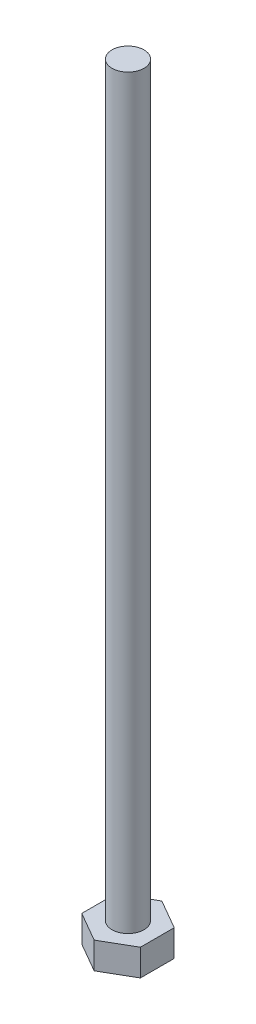
ISO-10303-21;
HEADER;
FILE_DESCRIPTION(('STEP AP214'),'2;1');
FILE_NAME('part.step','',(''),(''),'','','');
FILE_SCHEMA(('AUTOMOTIVE_DESIGN { 1 0 10303 214 1 1 1 1 }'));
ENDSEC;
DATA;
#1=APPLICATION_CONTEXT('core data for automotive mechanical design processes');
#2=APPLICATION_PROTOCOL_DEFINITION('international standard','automotive_design',2000,#1);
#3=PRODUCT_CONTEXT('',#1,'mechanical');
#4=PRODUCT('Part','Part','',(#3));
#5=PRODUCT_RELATED_PRODUCT_CATEGORY('part','',(#4));
#6=PRODUCT_DEFINITION_FORMATION('','',#4);
#7=PRODUCT_DEFINITION_CONTEXT('part definition',#1,'design');
#8=PRODUCT_DEFINITION('design','',#6,#7);
#9=PRODUCT_DEFINITION_SHAPE('','',#8);
#10=(LENGTH_UNIT() NAMED_UNIT(*) SI_UNIT(.MILLI.,.METRE.));
#11=(NAMED_UNIT(*) PLANE_ANGLE_UNIT() SI_UNIT($,.RADIAN.));
#12=(NAMED_UNIT(*) SI_UNIT($,.STERADIAN.) SOLID_ANGLE_UNIT());
#13=UNCERTAINTY_MEASURE_WITH_UNIT(LENGTH_MEASURE(1.E-05),#10,'distance_accuracy_value','');
#14=(GEOMETRIC_REPRESENTATION_CONTEXT(3) GLOBAL_UNCERTAINTY_ASSIGNED_CONTEXT((#13)) GLOBAL_UNIT_ASSIGNED_CONTEXT((#10,
#11,#12)) REPRESENTATION_CONTEXT('',''));
#15=CARTESIAN_POINT('',(0.,0.,0.));
#16=DIRECTION('',(0.,0.,1.));
#17=DIRECTION('',(1.,0.,0.));
#18=AXIS2_PLACEMENT_3D('',#15,#16,#17);
#19=CARTESIAN_POINT('',(0.,2.5,0.));
#20=DIRECTION('',(0.,1.,0.));
#21=DIRECTION('',(0.,0.,1.));
#22=AXIS2_PLACEMENT_3D('',#19,#20,#21);
#23=PLANE('',#22);
#24=DIRECTION('',(0.,0.,-1.));
#25=VECTOR('',#24,1.);
#26=CARTESIAN_POINT('',(2.75,2.5,1.58771324027147));
#27=LINE('',#26,#25);
#28=CARTESIAN_POINT('',(2.75,2.5,1.58771324027147));
#29=VERTEX_POINT('',#28);
#30=CARTESIAN_POINT('',(2.75,2.5,-1.58771324027147));
#31=VERTEX_POINT('',#30);
#32=EDGE_CURVE('E128',#29,#31,#27,.T.);
#33=ORIENTED_EDGE('',*,*,#32,.T.);
#34=DIRECTION('',(-0.866025403784439,0.,-0.5));
#35=VECTOR('',#34,1.);
#36=CARTESIAN_POINT('',(2.75,2.5,-1.58771324027147));
#37=LINE('',#36,#35);
#38=CARTESIAN_POINT('',(0.,2.5,-3.17542648054294));
#39=VERTEX_POINT('',#38);
#40=EDGE_CURVE('E86',#31,#39,#37,.T.);
#41=ORIENTED_EDGE('',*,*,#40,.T.);
#42=DIRECTION('',(-0.866025403784439,0.,0.5));
#43=VECTOR('',#42,1.);
#44=CARTESIAN_POINT('',(0.,2.5,-3.17542648054294));
#45=LINE('',#44,#43);
#46=CARTESIAN_POINT('',(-2.75,2.5,-1.58771324027147));
#47=VERTEX_POINT('',#46);
#48=EDGE_CURVE('E99',#39,#47,#45,.T.);
#49=ORIENTED_EDGE('',*,*,#48,.T.);
#50=DIRECTION('',(0.,0.,1.));
#51=VECTOR('',#50,1.);
#52=CARTESIAN_POINT('',(-2.75,2.5,-1.58771324027147));
#53=LINE('',#52,#51);
#54=CARTESIAN_POINT('',(-2.75,2.5,1.58771324027147));
#55=VERTEX_POINT('',#54);
#56=EDGE_CURVE('E93',#47,#55,#53,.T.);
#57=ORIENTED_EDGE('',*,*,#56,.T.);
#58=DIRECTION('',(0.866025403784439,0.,0.5));
#59=VECTOR('',#58,1.);
#60=CARTESIAN_POINT('',(-2.75,2.5,1.58771324027147));
#61=LINE('',#60,#59);
#62=CARTESIAN_POINT('',(0.,2.5,3.17542648054294));
#63=VERTEX_POINT('',#62);
#64=EDGE_CURVE('E97',#55,#63,#61,.T.);
#65=ORIENTED_EDGE('',*,*,#64,.T.);
#66=DIRECTION('',(0.866025403784438,0.,-0.5));
#67=VECTOR('',#66,1.);
#68=CARTESIAN_POINT('',(0.,2.5,3.17542648054294));
#69=LINE('',#68,#67);
#70=EDGE_CURVE('E49',#63,#29,#69,.T.);
#71=ORIENTED_EDGE('',*,*,#70,.T.);
#72=EDGE_LOOP('',(#33,#41,#49,#57,#65,#71));
#73=FACE_BOUND('',#72,.T.);
#74=CARTESIAN_POINT('',(0.,2.5,0.));
#75=DIRECTION('',(0.,1.,0.));
#76=DIRECTION('',(0.,0.,1.));
#77=AXIS2_PLACEMENT_3D('',#74,#75,#76);
#78=CIRCLE('',#77,1.5);
#79=CARTESIAN_POINT('',(0.,2.5,1.5));
#80=VERTEX_POINT('',#79);
#81=EDGE_CURVE('E168',#80,#80,#78,.T.);
#82=ORIENTED_EDGE('',*,*,#81,.F.);
#83=EDGE_LOOP('',(#82));
#84=FACE_BOUND('',#83,.T.);
#85=ADVANCED_FACE('F32',(#73,#84),#23,.T.);
#86=CARTESIAN_POINT('',(2.75,2.5,1.58771324027147));
#87=DIRECTION('',(-1.,0.,0.));
#88=DIRECTION('',(0.,0.,1.));
#89=AXIS2_PLACEMENT_3D('',#86,#87,#88);
#90=PLANE('',#89);
#91=DIRECTION('',(0.,0.,-1.));
#92=VECTOR('',#91,1.);
#93=CARTESIAN_POINT('',(2.75,0.,1.58771324027147));
#94=LINE('',#93,#92);
#95=CARTESIAN_POINT('',(2.75,0.,1.58771324027147));
#96=VERTEX_POINT('',#95);
#97=CARTESIAN_POINT('',(2.75,0.,-1.58771324027147));
#98=VERTEX_POINT('',#97);
#99=EDGE_CURVE('E117',#96,#98,#94,.T.);
#100=ORIENTED_EDGE('',*,*,#99,.T.);
#101=DIRECTION('',(0.,-1.,0.));
#102=VECTOR('',#101,1.);
#103=CARTESIAN_POINT('',(2.75,2.5,-1.58771324027147));
#104=LINE('',#103,#102);
#105=EDGE_CURVE('E11',#31,#98,#104,.T.);
#106=ORIENTED_EDGE('',*,*,#105,.F.);
#107=ORIENTED_EDGE('',*,*,#32,.F.);
#108=DIRECTION('',(0.,-1.,0.));
#109=VECTOR('',#108,1.);
#110=CARTESIAN_POINT('',(2.75,2.5,1.58771324027147));
#111=LINE('',#110,#109);
#112=EDGE_CURVE('E113',#29,#96,#111,.T.);
#113=ORIENTED_EDGE('',*,*,#112,.T.);
#114=EDGE_LOOP('',(#100,#106,#107,#113));
#115=FACE_BOUND('',#114,.T.);
#116=ADVANCED_FACE('F34',(#115),#90,.F.);
#117=CARTESIAN_POINT('',(2.75,2.5,-1.58771324027147));
#118=DIRECTION('',(-0.5,0.,0.866025403784439));
#119=DIRECTION('',(0.866025403784439,0.,0.5));
#120=AXIS2_PLACEMENT_3D('',#117,#118,#119);
#121=PLANE('',#120);
#122=DIRECTION('',(-0.866025403784439,0.,-0.5));
#123=VECTOR('',#122,1.);
#124=CARTESIAN_POINT('',(2.75,0.,-1.58771324027147));
#125=LINE('',#124,#123);
#126=CARTESIAN_POINT('',(0.,0.,-3.17542648054294));
#127=VERTEX_POINT('',#126);
#128=EDGE_CURVE('E120',#98,#127,#125,.T.);
#129=ORIENTED_EDGE('',*,*,#128,.T.);
#130=DIRECTION('',(0.,-1.,0.));
#131=VECTOR('',#130,1.);
#132=CARTESIAN_POINT('',(0.,2.5,-3.17542648054294));
#133=LINE('',#132,#131);
#134=EDGE_CURVE('E41',#39,#127,#133,.T.);
#135=ORIENTED_EDGE('',*,*,#134,.F.);
#136=ORIENTED_EDGE('',*,*,#40,.F.);
#137=ORIENTED_EDGE('',*,*,#105,.T.);
#138=EDGE_LOOP('',(#129,#135,#136,#137));
#139=FACE_BOUND('',#138,.T.);
#140=ADVANCED_FACE('F156',(#139),#121,.F.);
#141=CARTESIAN_POINT('',(0.,2.5,-3.17542648054294));
#142=DIRECTION('',(0.5,0.,0.866025403784438));
#143=DIRECTION('',(0.866025403784439,0.,-0.5));
#144=AXIS2_PLACEMENT_3D('',#141,#142,#143);
#145=PLANE('',#144);
#146=DIRECTION('',(-0.866025403784439,0.,0.5));
#147=VECTOR('',#146,1.);
#148=CARTESIAN_POINT('',(0.,0.,-3.17542648054294));
#149=LINE('',#148,#147);
#150=CARTESIAN_POINT('',(-2.75,0.,-1.58771324027147));
#151=VERTEX_POINT('',#150);
#152=EDGE_CURVE('E123',#127,#151,#149,.T.);
#153=ORIENTED_EDGE('',*,*,#152,.T.);
#154=DIRECTION('',(0.,-1.,0.));
#155=VECTOR('',#154,1.);
#156=CARTESIAN_POINT('',(-2.75,2.5,-1.58771324027147));
#157=LINE('',#156,#155);
#158=EDGE_CURVE('E108',#47,#151,#157,.T.);
#159=ORIENTED_EDGE('',*,*,#158,.F.);
#160=ORIENTED_EDGE('',*,*,#48,.F.);
#161=ORIENTED_EDGE('',*,*,#134,.T.);
#162=EDGE_LOOP('',(#153,#159,#160,#161));
#163=FACE_BOUND('',#162,.T.);
#164=ADVANCED_FACE('F134',(#163),#145,.F.);
#165=CARTESIAN_POINT('',(-2.75,2.5,-1.58771324027147));
#166=DIRECTION('',(1.,0.,0.));
#167=DIRECTION('',(0.,0.,-1.));
#168=AXIS2_PLACEMENT_3D('',#165,#166,#167);
#169=PLANE('',#168);
#170=DIRECTION('',(0.,0.,1.));
#171=VECTOR('',#170,1.);
#172=CARTESIAN_POINT('',(-2.75,0.,-1.58771324027147));
#173=LINE('',#172,#171);
#174=CARTESIAN_POINT('',(-2.75,0.,1.58771324027147));
#175=VERTEX_POINT('',#174);
#176=EDGE_CURVE('E107',#151,#175,#173,.T.);
#177=ORIENTED_EDGE('',*,*,#176,.T.);
#178=DIRECTION('',(0.,-1.,0.));
#179=VECTOR('',#178,1.);
#180=CARTESIAN_POINT('',(-2.75,2.5,1.58771324027147));
#181=LINE('',#180,#179);
#182=EDGE_CURVE('E104',#55,#175,#181,.T.);
#183=ORIENTED_EDGE('',*,*,#182,.F.);
#184=ORIENTED_EDGE('',*,*,#56,.F.);
#185=ORIENTED_EDGE('',*,*,#158,.T.);
#186=EDGE_LOOP('',(#177,#183,#184,#185));
#187=FACE_BOUND('',#186,.T.);
#188=ADVANCED_FACE('F105',(#187),#169,.F.);
#189=CARTESIAN_POINT('',(-2.75,2.5,1.58771324027147));
#190=DIRECTION('',(0.5,0.,-0.866025403784439));
#191=DIRECTION('',(-0.866025403784439,0.,-0.5));
#192=AXIS2_PLACEMENT_3D('',#189,#190,#191);
#193=PLANE('',#192);
#194=DIRECTION('',(0.866025403784439,0.,0.5));
#195=VECTOR('',#194,1.);
#196=CARTESIAN_POINT('',(-2.75,0.,1.58771324027147));
#197=LINE('',#196,#195);
#198=CARTESIAN_POINT('',(0.,0.,3.17542648054294));
#199=VERTEX_POINT('',#198);
#200=EDGE_CURVE('E72',#175,#199,#197,.T.);
#201=ORIENTED_EDGE('',*,*,#200,.T.);
#202=DIRECTION('',(0.,-1.,0.));
#203=VECTOR('',#202,1.);
#204=CARTESIAN_POINT('',(0.,2.5,3.17542648054294));
#205=LINE('',#204,#203);
#206=EDGE_CURVE('E109',#63,#199,#205,.T.);
#207=ORIENTED_EDGE('',*,*,#206,.F.);
#208=ORIENTED_EDGE('',*,*,#64,.F.);
#209=ORIENTED_EDGE('',*,*,#182,.T.);
#210=EDGE_LOOP('',(#201,#207,#208,#209));
#211=FACE_BOUND('',#210,.T.);
#212=ADVANCED_FACE('F111',(#211),#193,.F.);
#213=CARTESIAN_POINT('',(0.,2.5,3.17542648054294));
#214=DIRECTION('',(-0.5,0.,-0.866025403784439));
#215=DIRECTION('',(-0.866025403784439,0.,0.5));
#216=AXIS2_PLACEMENT_3D('',#213,#214,#215);
#217=PLANE('',#216);
#218=DIRECTION('',(0.866025403784438,0.,-0.5));
#219=VECTOR('',#218,1.);
#220=CARTESIAN_POINT('',(0.,0.,3.17542648054294));
#221=LINE('',#220,#219);
#222=EDGE_CURVE('E78',#199,#96,#221,.T.);
#223=ORIENTED_EDGE('',*,*,#222,.T.);
#224=ORIENTED_EDGE('',*,*,#112,.F.);
#225=ORIENTED_EDGE('',*,*,#70,.F.);
#226=ORIENTED_EDGE('',*,*,#206,.T.);
#227=EDGE_LOOP('',(#223,#224,#225,#226));
#228=FACE_BOUND('',#227,.T.);
#229=ADVANCED_FACE('F141',(#228),#217,.F.);
#230=CARTESIAN_POINT('',(0.,0.,0.));
#231=DIRECTION('',(0.,1.,0.));
#232=DIRECTION('',(0.,0.,1.));
#233=AXIS2_PLACEMENT_3D('',#230,#231,#232);
#234=PLANE('',#233);
#235=ORIENTED_EDGE('',*,*,#99,.F.);
#236=ORIENTED_EDGE('',*,*,#222,.F.);
#237=ORIENTED_EDGE('',*,*,#200,.F.);
#238=ORIENTED_EDGE('',*,*,#176,.F.);
#239=ORIENTED_EDGE('',*,*,#152,.F.);
#240=ORIENTED_EDGE('',*,*,#128,.F.);
#241=EDGE_LOOP('',(#235,#236,#237,#238,#239,#240));
#242=FACE_BOUND('',#241,.T.);
#243=ADVANCED_FACE('F137',(#242),#234,.F.);
#244=CARTESIAN_POINT('',(0.,72.5,0.));
#245=DIRECTION('',(0.,-1.,0.));
#246=DIRECTION('',(0.,0.,-1.));
#247=AXIS2_PLACEMENT_3D('',#244,#245,#246);
#248=CYLINDRICAL_SURFACE('',#247,1.5);
#249=CARTESIAN_POINT('',(0.,72.5,0.));
#250=DIRECTION('',(0.,1.,0.));
#251=DIRECTION('',(0.,0.,1.));
#252=AXIS2_PLACEMENT_3D('',#249,#250,#251);
#253=CIRCLE('',#252,1.5);
#254=CARTESIAN_POINT('',(0.,72.5,1.5));
#255=VERTEX_POINT('',#254);
#256=EDGE_CURVE('E121',#255,#255,#253,.T.);
#257=ORIENTED_EDGE('',*,*,#256,.F.);
#258=EDGE_LOOP('',(#257));
#259=FACE_BOUND('',#258,.T.);
#260=ORIENTED_EDGE('',*,*,#81,.T.);
#261=EDGE_LOOP('',(#260));
#262=FACE_BOUND('',#261,.T.);
#263=ADVANCED_FACE('F148',(#259,#262),#248,.T.);
#264=CARTESIAN_POINT('',(0.,72.5,0.));
#265=DIRECTION('',(0.,1.,0.));
#266=DIRECTION('',(0.,0.,1.));
#267=AXIS2_PLACEMENT_3D('',#264,#265,#266);
#268=PLANE('',#267);
#269=ORIENTED_EDGE('',*,*,#256,.T.);
#270=EDGE_LOOP('',(#269));
#271=FACE_BOUND('',#270,.T.);
#272=ADVANCED_FACE('F160',(#271),#268,.T.);
#273=CLOSED_SHELL('',(#85,#116,#140,#164,#188,#212,#229,#243,#263,#272));
#274=MANIFOLD_SOLID_BREP('B2',#273);
#275=ADVANCED_BREP_SHAPE_REPRESENTATION('',(#18,#274),#14);
#276=SHAPE_DEFINITION_REPRESENTATION(#9,#275);
ENDSEC;
END-ISO-10303-21;
